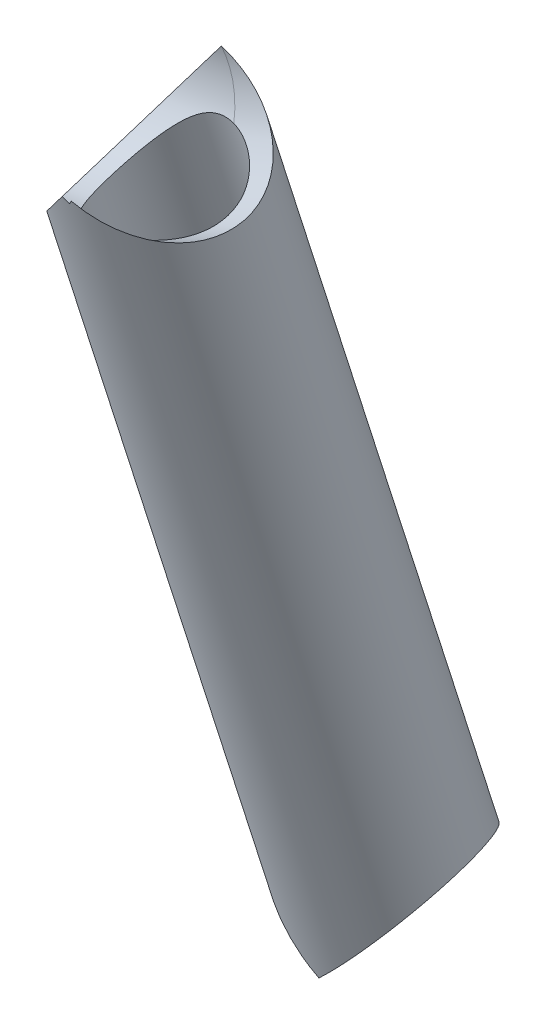
ISO-10303-21;
HEADER;
FILE_DESCRIPTION(('STEP AP214'),'2;1');
FILE_NAME('part.step','',(''),(''),'','','');
FILE_SCHEMA(('AUTOMOTIVE_DESIGN { 1 0 10303 214 1 1 1 1 }'));
ENDSEC;
DATA;
#1=APPLICATION_CONTEXT('core data for automotive mechanical design processes');
#2=APPLICATION_PROTOCOL_DEFINITION('international standard','automotive_design',2000,#1);
#3=PRODUCT_CONTEXT('',#1,'mechanical');
#4=PRODUCT('Part','Part','',(#3));
#5=PRODUCT_RELATED_PRODUCT_CATEGORY('part','',(#4));
#6=PRODUCT_DEFINITION_FORMATION('','',#4);
#7=PRODUCT_DEFINITION_CONTEXT('part definition',#1,'design');
#8=PRODUCT_DEFINITION('design','',#6,#7);
#9=PRODUCT_DEFINITION_SHAPE('','',#8);
#10=(LENGTH_UNIT() NAMED_UNIT(*) SI_UNIT(.MILLI.,.METRE.));
#11=(NAMED_UNIT(*) PLANE_ANGLE_UNIT() SI_UNIT($,.RADIAN.));
#12=(NAMED_UNIT(*) SI_UNIT($,.STERADIAN.) SOLID_ANGLE_UNIT());
#13=UNCERTAINTY_MEASURE_WITH_UNIT(LENGTH_MEASURE(1.E-05),#10,'distance_accuracy_value','');
#14=(GEOMETRIC_REPRESENTATION_CONTEXT(3) GLOBAL_UNCERTAINTY_ASSIGNED_CONTEXT((#13)) GLOBAL_UNIT_ASSIGNED_CONTEXT((#10,
#11,#12)) REPRESENTATION_CONTEXT('',''));
#15=CARTESIAN_POINT('',(0.,0.,0.));
#16=DIRECTION('',(0.,0.,1.));
#17=DIRECTION('',(1.,0.,0.));
#18=AXIS2_PLACEMENT_3D('',#15,#16,#17);
#19=CARTESIAN_POINT('',(549.76326332179,1.17961196366423E-13,200.));
#20=DIRECTION('',(0.,0.95272535252887,0.303832853142546));
#21=DIRECTION('',(0.,-0.303832853142546,0.952725352528871));
#22=AXIS2_PLACEMENT_3D('',#19,#20,#21);
#23=CYLINDRICAL_SURFACE('',#22,9.65000000000003);
#24=CARTESIAN_POINT('',(550.698039428662,109.484435551692,244.996794368476));
#25=CARTESIAN_POINT('',(550.881581643102,109.566394338462,245.004213785763));
#26=CARTESIAN_POINT('',(551.067205147599,109.644542456331,245.004567755101));
#27=CARTESIAN_POINT('',(551.441272790003,109.792442626243,244.990319027908));
#28=CARTESIAN_POINT('',(551.629717996396,109.862191402456,244.97571051683));
#29=CARTESIAN_POINT('',(552.006309312038,109.991890817097,244.930898310792));
#30=CARTESIAN_POINT('',(552.194443954556,110.051920856962,244.900830360672));
#31=CARTESIAN_POINT('',(552.570217718864,110.162658830874,244.824920725487));
#32=CARTESIAN_POINT('',(552.757856955263,110.213369149442,244.77908308386));
#33=CARTESIAN_POINT('',(553.131337378484,110.305875102178,244.671707070123));
#34=CARTESIAN_POINT('',(553.317173070384,110.347648714515,244.610130715032));
#35=CARTESIAN_POINT('',(553.684904472099,110.422906426049,244.471971576444));
#36=CARTESIAN_POINT('',(553.866799660256,110.456389433752,244.395386819401));
#37=CARTESIAN_POINT('',(554.225484036437,110.516245356894,244.228022283843));
#38=CARTESIAN_POINT('',(554.402264543243,110.54260675216,244.137219876654));
#39=CARTESIAN_POINT('',(554.749321723969,110.589495836218,243.942584303863));
#40=CARTESIAN_POINT('',(554.919596748016,110.610022053525,243.838747860903));
#41=CARTESIAN_POINT('',(555.299177028189,110.651736875844,243.588575847054));
#42=CARTESIAN_POINT('',(555.506148369993,110.671518490651,243.438457210947));
#43=CARTESIAN_POINT('',(555.906788012326,110.706638809108,243.120934223244));
#44=CARTESIAN_POINT('',(556.100452562977,110.721976264272,242.953525032138));
#45=CARTESIAN_POINT('',(556.473769897959,110.750737217947,242.603205122193));
#46=CARTESIAN_POINT('',(556.653405791074,110.764158424818,242.420276253129));
#47=CARTESIAN_POINT('',(556.997666401102,110.791242420639,242.040864301523));
#48=CARTESIAN_POINT('',(557.162292190321,110.804905192248,241.844382188974));
#49=CARTESIAN_POINT('',(557.478348379293,110.834550919873,241.436261312558));
#50=CARTESIAN_POINT('',(557.629530642542,110.850566975223,241.224432829273));
#51=CARTESIAN_POINT('',(557.915033371628,110.886373108481,240.790003674337));
#52=CARTESIAN_POINT('',(558.049353720248,110.906163212622,240.567402927815));
#53=CARTESIAN_POINT('',(558.300343888742,110.950843614606,240.1130933081));
#54=CARTESIAN_POINT('',(558.417022553328,110.975731341903,239.881389072871));
#55=CARTESIAN_POINT('',(558.632072138232,111.031693868641,239.41034225666));
#56=CARTESIAN_POINT('',(558.73044238973,111.062768894023,239.170999397007));
#57=CARTESIAN_POINT('',(558.914537580053,111.134441459816,238.66887530459));
#58=CARTESIAN_POINT('',(558.998844049748,111.175563161971,238.405646463527));
#59=CARTESIAN_POINT('',(559.14474216268,111.26663147728,237.874436356593));
#60=CARTESIAN_POINT('',(559.206332567954,111.316578571175,237.606454832547));
#61=CARTESIAN_POINT('',(559.306082308514,111.42572068666,237.068043330455));
#62=CARTESIAN_POINT('',(559.34424420614,111.484914696041,236.797613623447));
#63=CARTESIAN_POINT('',(559.396629612229,111.612668506386,236.2566534733));
#64=CARTESIAN_POINT('',(559.410854975487,111.681227581225,235.986123039592));
#65=CARTESIAN_POINT('',(559.41497267861,111.822775813274,235.464792583113));
#66=CARTESIAN_POINT('',(559.406378912521,111.895191884138,235.213847854031));
#67=CARTESIAN_POINT('',(559.368035815093,112.047628921864,234.715920544952));
#68=CARTESIAN_POINT('',(559.338287390049,112.127649562809,234.468937795682));
#69=CARTESIAN_POINT('',(559.257879022078,112.294648434509,233.980850403866));
#70=CARTESIAN_POINT('',(559.207222671558,112.381625467945,233.739744759047));
#71=CARTESIAN_POINT('',(559.08545419463,112.561710102316,233.265112507336));
#72=CARTESIAN_POINT('',(559.014342171348,112.654817672343,233.031585862242));
#73=CARTESIAN_POINT('',(558.854852446097,112.843140803751,232.58085840355));
#74=CARTESIAN_POINT('',(558.767084963752,112.938199118691,232.363375364454));
#75=CARTESIAN_POINT('',(558.573698403751,113.132029938323,231.938240267824));
#76=CARTESIAN_POINT('',(558.468079840252,113.230802335974,231.730587927359));
#77=CARTESIAN_POINT('',(558.239827336573,113.43085231516,231.326173037617));
#78=CARTESIAN_POINT('',(558.117195261543,113.532129621088,231.12940929795));
#79=CARTESIAN_POINT('',(557.855783983508,113.73588508475,230.747580192732));
#80=CARTESIAN_POINT('',(557.717004132927,113.838363290496,230.562515296802));
#81=CARTESIAN_POINT('',(557.417454025893,114.04779533895,230.196500000782));
#82=CARTESIAN_POINT('',(557.255965694797,114.154738123503,230.016130864163));
#83=CARTESIAN_POINT('',(556.917315168159,114.36656108676,229.669445096046));
#84=CARTESIAN_POINT('',(556.740152440746,114.471441195325,229.503128941775));
#85=CARTESIAN_POINT('',(556.370804864086,114.67731490012,229.184630482026));
#86=CARTESIAN_POINT('',(556.17859413249,114.778301333519,229.032473559324));
#87=CARTESIAN_POINT('',(555.780365612246,114.973919860812,228.742837046828));
#88=CARTESIAN_POINT('',(555.574347472067,115.068551792801,228.605357830953));
#89=CARTESIAN_POINT('',(555.136205118418,115.254475255379,228.337075078194));
#90=CARTESIAN_POINT('',(554.903254144052,115.345192436493,228.20721937849));
#91=CARTESIAN_POINT('',(554.423984993501,115.512913232271,227.964174746746));
#92=CARTESIAN_POINT('',(554.177664101202,115.589914046731,227.850989218744));
#93=CARTESIAN_POINT('',(553.674012405421,115.725757345622,227.641584260961));
#94=CARTESIAN_POINT('',(553.416719274576,115.78465703395,227.545311803749));
#95=CARTESIAN_POINT('',(552.892562630669,115.879942104992,227.369193553604));
#96=CARTESIAN_POINT('',(552.625705560243,115.916342353425,227.28933693781));
#97=CARTESIAN_POINT('',(552.172695592737,115.954626211558,227.168930621738));
#98=CARTESIAN_POINT('',(551.98830034342,115.963859191771,227.124014028903));
#99=CARTESIAN_POINT('',(551.617736437598,115.968626230974,227.041423558787));
#100=CARTESIAN_POINT('',(551.431568284748,115.96416407124,227.00374768537));
#101=CARTESIAN_POINT('',(551.058960029859,115.940610303518,226.935455022241));
#102=CARTESIAN_POINT('',(550.872520152049,115.921527297861,226.90483409545));
#103=CARTESIAN_POINT('',(550.500862439488,115.868320136744,226.850362452704));
#104=CARTESIAN_POINT('',(550.315644350711,115.834199214752,226.826510283135));
#105=CARTESIAN_POINT('',(549.890174376933,115.737950368295,226.778759760704));
#106=CARTESIAN_POINT('',(549.650857480254,115.670397418027,226.757187374206));
#107=CARTESIAN_POINT('',(549.297590076094,115.551063811716,226.732497674503));
#108=CARTESIAN_POINT('',(549.180755973486,115.508271781476,226.725545111857));
#109=CARTESIAN_POINT('',(548.94919801947,115.417028447761,226.71408248341));
#110=CARTESIAN_POINT('',(548.834474108189,115.368577305141,226.709572348204));
#111=CARTESIAN_POINT('',(548.720894557649,115.317466106978,226.706224291481));
#112=B_SPLINE_CURVE_WITH_KNOTS('',3,(#24,#25,#26,#27,#28,#29,#30,#31,#32,#33,#34,#35,#36,#37,
#38,#39,#40,#41,#42,#43,#44,#45,#46,#47,#48,#49,#50,#51,#52,#53,#54,#55,#56,#57,#58,#59,#60,#61,
#62,#63,#64,#65,#66,#67,#68,#69,#70,#71,#72,#73,#74,#75,#76,#77,#78,#79,#80,#81,#82,#83,#84,#85,
#86,#87,#88,#89,#90,#91,#92,#93,#94,#95,#96,#97,#98,#99,#100,#101,#102,#103,#104,#105,#106,#107,
#108,#109,#110,#111),.UNSPECIFIED.,.F.,.F.,(4,2,2,2,2,2,2,2,2,2,2,2,2,2,2,2,2,2,2,2,2,2,2,2,2,2,
2,2,2,2,2,2,2,2,2,2,2,2,2,2,2,2,2,4),(0.,0.603401911009914,1.20703839807765,1.80546282042542,
2.40373391754958,3.0034627125777,3.6032704225785,4.20404267070255,4.80496628437935,
5.57321395701299,6.34167724277525,7.11105197133311,7.88037169345746,8.66178608143956,
9.44320590124379,10.2242326454021,11.0052879154709,11.8425224944068,12.6798026935898,
13.5169913043671,14.3541150400877,15.1371105115038,15.9200724402833,16.7028998962525,
17.4857234057292,18.2440396320003,19.0023340204592,19.7605453445096,20.518787085754,
21.3119222678827,22.1050843734451,22.8996420142938,23.6942198918678,24.538244731251,
25.3824416816996,26.2239426625353,27.064887055007,27.6343517263137,28.2036591805505,
28.7726319335976,29.3414824051636,30.0885224507664,30.462236794177,30.8359405176508),.UNSPECIFIED.);
#113=CARTESIAN_POINT('',(552.9506630298,110.261122917512,244.723648048167));
#114=VERTEX_POINT('',#113);
#115=CARTESIAN_POINT('',(552.000788998511,115.961111324283,227.128263209496));
#116=VERTEX_POINT('',#115);
#117=EDGE_CURVE('E116',#114,#116,#112,.T.);
#118=ORIENTED_EDGE('',*,*,#117,.T.);
#119=CARTESIAN_POINT('',(549.76326332179,109.975863240767,245.201148674115));
#120=CARTESIAN_POINT('',(549.9634546001,110.019916320632,245.215196869599));
#121=CARTESIAN_POINT('',(550.165307901028,110.059083582522,245.221137583805));
#122=CARTESIAN_POINT('',(550.570552825056,110.127049074594,245.216106583122));
#123=CARTESIAN_POINT('',(550.773944438698,110.155847368475,245.205134972132));
#124=CARTESIAN_POINT('',(551.180423033904,110.203144725606,245.16612172139));
#125=CARTESIAN_POINT('',(551.383509708,110.221636660967,245.138068295826));
#126=CARTESIAN_POINT('',(551.787316770269,110.248998695428,245.065298121469));
#127=CARTESIAN_POINT('',(551.98803699928,110.257868150948,245.020580258379));
#128=CARTESIAN_POINT('',(552.383703703847,110.267166591259,244.915794468131));
#129=CARTESIAN_POINT('',(552.578685512266,110.267669415926,244.855865572658));
#130=CARTESIAN_POINT('',(552.963528778638,110.261908055358,244.721530033714));
#131=CARTESIAN_POINT('',(553.15338755417,110.255640392959,244.647115967093));
#132=CARTESIAN_POINT('',(553.714229729974,110.229072097724,244.403684156985));
#133=CARTESIAN_POINT('',(554.07628523899,110.201004703115,244.214529724227));
#134=CARTESIAN_POINT('',(554.666278688278,110.146113621938,243.855499316274));
#135=CARTESIAN_POINT('',(554.90165491087,110.12148241524,243.697102594484));
#136=CARTESIAN_POINT('',(555.358004067127,110.071501830009,243.360642036257));
#137=CARTESIAN_POINT('',(555.578972330568,110.046152222395,243.182571872731));
#138=CARTESIAN_POINT('',(556.005820845144,109.997716098286,242.808634613583));
#139=CARTESIAN_POINT('',(556.211689075402,109.97463138,242.612753611002));
#140=CARTESIAN_POINT('',(556.607410978175,109.933294290981,242.204993684445));
#141=CARTESIAN_POINT('',(556.797266232797,109.91504144247,241.993116344861));
#142=CARTESIAN_POINT('',(557.16199318824,109.885404324874,241.552591687812));
#143=CARTESIAN_POINT('',(557.336686679089,109.874094169562,241.323791676807));
#144=CARTESIAN_POINT('',(557.667738161875,109.860603739476,240.853003599556));
#145=CARTESIAN_POINT('',(557.82409565684,109.858423712105,240.611015176116));
#146=CARTESIAN_POINT('',(558.117116334747,109.864874764263,240.115731230429));
#147=CARTESIAN_POINT('',(558.253793105132,109.873498344766,239.862443668809));
#148=CARTESIAN_POINT('',(558.506224741361,109.902947677151,239.34631550793));
#149=CARTESIAN_POINT('',(558.621980840241,109.923772709591,239.083475472778));
#150=CARTESIAN_POINT('',(558.828082916247,109.977900091243,238.558362449391));
#151=CARTESIAN_POINT('',(558.919084636021,110.01081114634,238.296307051674));
#152=CARTESIAN_POINT('',(559.078946387722,110.089836451659,237.76744963628));
#153=CARTESIAN_POINT('',(559.147806588626,110.135950601113,237.500647654845));
#154=CARTESIAN_POINT('',(559.262355117916,110.241678135343,236.964920118654));
#155=CARTESIAN_POINT('',(559.308057990581,110.301283012962,236.695996004802));
#156=CARTESIAN_POINT('',(559.375637075682,110.433943460572,236.158480587196));
#157=CARTESIAN_POINT('',(559.397516112611,110.506997434873,235.889889247762));
#158=CARTESIAN_POINT('',(559.415953366756,110.656731163836,235.387073849114));
#159=CARTESIAN_POINT('',(559.415182232547,110.731978842211,235.152516344233));
#160=CARTESIAN_POINT('',(559.394828533204,110.891991545254,234.687516635222));
#161=CARTESIAN_POINT('',(559.375247702842,110.976755691605,234.457074053578));
#162=CARTESIAN_POINT('',(559.317527538014,111.155000094427,234.001988694555));
#163=CARTESIAN_POINT('',(559.279389686438,111.248479653968,233.777345455261));
#164=CARTESIAN_POINT('',(559.185022271188,111.44318287009,233.335337647127));
#165=CARTESIAN_POINT('',(559.12879236789,111.544406672018,233.117973215008));
#166=CARTESIAN_POINT('',(559.000371600791,111.751078284084,232.696698650233));
#167=CARTESIAN_POINT('',(558.928574897405,111.85637667972,232.492594559923));
#168=CARTESIAN_POINT('',(558.769042116872,112.072137351278,232.09357475383));
#169=CARTESIAN_POINT('',(558.681306482387,112.182599483728,231.89865878306));
#170=CARTESIAN_POINT('',(558.490685437882,112.407459048784,231.518806508098));
#171=CARTESIAN_POINT('',(558.387801531828,112.521856089858,231.33386921568));
#172=CARTESIAN_POINT('',(558.16766851358,112.753333443992,230.974509955233));
#173=CARTESIAN_POINT('',(558.050417781106,112.87041405849,230.800089176564));
#174=CARTESIAN_POINT('',(557.79135055153,113.11635895838,230.447211623137));
#175=CARTESIAN_POINT('',(557.648278285843,113.245349010812,230.269764019591));
#176=CARTESIAN_POINT('',(557.346974508563,113.503158797502,229.928116467741));
#177=CARTESIAN_POINT('',(557.188742149096,113.631978521825,229.763917261338));
#178=CARTESIAN_POINT('',(556.857648324522,113.887788248378,229.448615885941));
#179=CARTESIAN_POINT('',(556.684760892019,114.014774515625,229.297537967432));
#180=CARTESIAN_POINT('',(556.325318993714,114.264610029118,229.008821105734));
#181=CARTESIAN_POINT('',(556.138764223729,114.387459183199,228.871182461812));
#182=CARTESIAN_POINT('',(555.730287647052,114.640530891462,228.594147632414));
#183=CARTESIAN_POINT('',(555.506768715832,114.769968738686,228.456381003873));
#184=CARTESIAN_POINT('',(555.044138173575,115.017160632341,228.197282697493));
#185=CARTESIAN_POINT('',(554.805022261513,115.134911433186,228.07595558164));
#186=CARTESIAN_POINT('',(554.312644914728,115.354025867711,227.84989583402));
#187=CARTESIAN_POINT('',(554.059418715352,115.455428057967,227.745124169849));
#188=CARTESIAN_POINT('',(553.539565934702,115.636988281309,227.55178657457));
#189=CARTESIAN_POINT('',(553.272949122394,115.717161541404,227.463209041988));
#190=CARTESIAN_POINT('',(552.824755455249,115.827013239295,227.330704057435));
#191=CARTESIAN_POINT('',(552.646463192946,115.864521215445,227.282066722795));
#192=CARTESIAN_POINT('',(552.286004325275,115.92681066068,227.191541813069));
#193=CARTESIAN_POINT('',(552.103838996273,115.951596256737,227.149652052189));
#194=CARTESIAN_POINT('',(551.737025438186,115.98709452443,227.072678501808));
#195=CARTESIAN_POINT('',(551.552381914302,115.997830858015,227.037583353916));
#196=CARTESIAN_POINT('',(551.181667380839,116.004352674121,226.974084567425));
#197=CARTESIAN_POINT('',(550.99559635377,116.000137973163,226.945681010948));
#198=CARTESIAN_POINT('',(550.623061856763,115.97629910435,226.895430534109));
#199=CARTESIAN_POINT('',(550.436598614483,115.956635164842,226.873600737788));
#200=CARTESIAN_POINT('',(550.065278379949,115.90204078665,226.836467912011));
#201=CARTESIAN_POINT('',(549.880421369628,115.867110519894,226.821164809057));
#202=CARTESIAN_POINT('',(549.513439215618,115.782709943031,226.79689176459));
#203=CARTESIAN_POINT('',(549.331317298806,115.73322368968,226.787928804314));
#204=CARTESIAN_POINT('',(548.971006729789,115.620932728738,226.776152520109));
#205=CARTESIAN_POINT('',(548.792819228331,115.558124180121,226.773340972379));
#206=CARTESIAN_POINT('',(548.379848438894,115.396700469569,226.773719529044));
#207=CARTESIAN_POINT('',(548.146960302229,115.293232295231,226.779340027354));
#208=CARTESIAN_POINT('',(547.690474654813,115.068461753578,226.800956057156));
#209=CARTESIAN_POINT('',(547.466880860139,114.947152339269,226.816955696793));
#210=CARTESIAN_POINT('',(547.028522828361,114.68981885095,226.859109652717));
#211=CARTESIAN_POINT('',(546.813785620311,114.553753757949,226.885292828348));
#212=CARTESIAN_POINT('',(546.393587795436,114.270194573631,226.947694627227));
#213=CARTESIAN_POINT('',(546.188127232081,114.12270041645,226.983913308309));
#214=CARTESIAN_POINT('',(545.690426062326,113.74647561094,227.086058375244));
#215=CARTESIAN_POINT('',(545.403376366959,113.512465551212,227.157921715903));
#216=CARTESIAN_POINT('',(544.847363307928,113.031251542761,227.324302964778));
#217=CARTESIAN_POINT('',(544.578409130546,112.784041005272,227.418832270005));
#218=CARTESIAN_POINT('',(544.058219571466,112.281513503806,227.631729483467));
#219=CARTESIAN_POINT('',(543.806979909307,112.026198519926,227.750091606003));
#220=CARTESIAN_POINT('',(543.322465974213,111.511750381845,228.012256113292));
#221=CARTESIAN_POINT('',(543.089184234729,111.252618868457,228.15604784202));
#222=CARTESIAN_POINT('',(542.693159774841,110.794199446877,228.434734406057));
#223=CARTESIAN_POINT('',(542.526539305416,110.594864638065,228.564060197769));
#224=CARTESIAN_POINT('',(542.205438016533,110.198230879066,228.839884202087));
#225=CARTESIAN_POINT('',(542.050957207784,110.000931930674,228.986382429841));
#226=CARTESIAN_POINT('',(541.755654889493,109.610880123103,229.297169381766));
#227=CARTESIAN_POINT('',(541.614809450212,109.418119766042,229.461425827097));
#228=CARTESIAN_POINT('',(541.348105636225,109.039249332012,229.808672344227));
#229=CARTESIAN_POINT('',(541.222241438681,108.853136691055,229.99165508581));
#230=CARTESIAN_POINT('',(541.015760298076,108.534094796603,230.330324404103));
#231=CARTESIAN_POINT('',(540.931552718786,108.399166555664,230.481947201521));
#232=CARTESIAN_POINT('',(540.773866289386,108.136128246428,230.796163573139));
#233=CARTESIAN_POINT('',(540.700381304537,108.008014306327,230.958750795761));
#234=CARTESIAN_POINT('',(540.565117055794,107.760008762316,231.29468557097));
#235=CARTESIAN_POINT('',(540.503335380576,107.640115467897,231.468030897188));
#236=CARTESIAN_POINT('',(540.392467147528,107.410029486356,231.824958004935));
#237=CARTESIAN_POINT('',(540.343380721977,107.299836900319,232.008539893101));
#238=CARTESIAN_POINT('',(540.258482834333,107.089786862604,232.386566584015));
#239=CARTESIAN_POINT('',(540.222783944748,106.990021928253,232.581088351116));
#240=CARTESIAN_POINT('',(540.166002506339,106.803283109686,232.978257787773));
#241=CARTESIAN_POINT('',(540.144919905149,106.716309179643,233.180905428213));
#242=CARTESIAN_POINT('',(540.117866654351,106.556355398659,233.5925220117));
#243=CARTESIAN_POINT('',(540.111888466098,106.483368583534,233.801487748648));
#244=CARTESIAN_POINT('',(540.115168413285,106.352146640046,234.223871262179));
#245=CARTESIAN_POINT('',(540.124425184088,106.293910190991,234.437288638327));
#246=CARTESIAN_POINT('',(540.155876129218,106.198811947143,234.840021792754));
#247=CARTESIAN_POINT('',(540.176334833758,106.160200223417,235.029065564939));
#248=CARTESIAN_POINT('',(540.2284303565,106.094558262766,235.407690100039));
#249=CARTESIAN_POINT('',(540.260071275486,106.067532282667,235.59727103461));
#250=CARTESIAN_POINT('',(540.334012807019,106.024828407898,235.97562156837));
#251=CARTESIAN_POINT('',(540.376313758545,106.009150874159,236.164391141565));
#252=CARTESIAN_POINT('',(540.470948023295,105.988686022466,236.540007276758));
#253=CARTESIAN_POINT('',(540.523283436459,105.98390098672,236.726853427595));
#254=CARTESIAN_POINT('',(540.654223571681,105.984744663654,237.152665718845));
#255=CARTESIAN_POINT('',(540.73601583267,105.993882791806,237.390654605637));
#256=CARTESIAN_POINT('',(540.913767351944,106.027938353897,237.860057627066));
#257=CARTESIAN_POINT('',(541.009730174823,106.052859763312,238.091470089891));
#258=CARTESIAN_POINT('',(541.316961370928,106.148927047828,238.774590645774));
#259=CARTESIAN_POINT('',(541.547484400736,106.241371793227,239.214903226503));
#260=CARTESIAN_POINT('',(541.970244419686,106.43361206851,239.924955111587));
#261=CARTESIAN_POINT('',(542.151611865375,106.521884939514,240.204678988825));
#262=CARTESIAN_POINT('',(542.531680084085,106.715018727272,240.746280918159));
#263=CARTESIAN_POINT('',(542.730387632222,106.819886140971,241.008151922963));
#264=CARTESIAN_POINT('',(543.144092194265,107.042893165864,241.513858674705));
#265=CARTESIAN_POINT('',(543.359131232113,107.161067422523,241.757644467474));
#266=CARTESIAN_POINT('',(543.804211273161,107.40703834607,242.225795854723));
#267=CARTESIAN_POINT('',(544.034250127505,107.534833635063,242.450164220251));
#268=CARTESIAN_POINT('',(544.516198841488,107.800541725061,242.88499198106));
#269=CARTESIAN_POINT('',(544.768554530637,107.938642034866,243.09484309286));
#270=CARTESIAN_POINT('',(545.28948826406,108.217551653759,243.491637990458));
#271=CARTESIAN_POINT('',(545.558072199016,108.358361933745,243.678573382606));
#272=CARTESIAN_POINT('',(546.111342556936,108.637620124482,244.026424740333));
#273=CARTESIAN_POINT('',(546.395969488808,108.776074566508,244.187429267102));
#274=CARTESIAN_POINT('',(546.982858672242,109.045532171543,244.480362911299));
#275=CARTESIAN_POINT('',(547.285103277819,109.176542539353,244.612320510282));
#276=CARTESIAN_POINT('',(547.937928888575,109.436475440679,244.853052236188));
#277=CARTESIAN_POINT('',(548.290374491198,109.564018441295,244.958435126517));
#278=CARTESIAN_POINT('',(548.833304491107,109.735185653313,245.079064636691));
#279=CARTESIAN_POINT('',(549.016574484542,109.788864352978,245.11302696243));
#280=CARTESIAN_POINT('',(549.387159273421,109.888429217533,245.167441886946));
#281=CARTESIAN_POINT('',(549.574472237791,109.934318829984,245.187900474314));
#282=CARTESIAN_POINT('',(549.76326332179,109.975863240767,245.201148674115));
#283=B_SPLINE_CURVE_WITH_KNOTS('',3,(#119,#120,#121,#122,#123,#124,#125,#126,#127,#128,#129,
#130,#131,#132,#133,#134,#135,#136,#137,#138,#139,#140,#141,#142,#143,#144,#145,#146,#147,#148,
#149,#150,#151,#152,#153,#154,#155,#156,#157,#158,#159,#160,#161,#162,#163,#164,#165,#166,#167,
#168,#169,#170,#171,#172,#173,#174,#175,#176,#177,#178,#179,#180,#181,#182,#183,#184,#185,#186,
#187,#188,#189,#190,#191,#192,#193,#194,#195,#196,#197,#198,#199,#200,#201,#202,#203,#204,#205,
#206,#207,#208,#209,#210,#211,#212,#213,#214,#215,#216,#217,#218,#219,#220,#221,#222,#223,#224,
#225,#226,#227,#228,#229,#230,#231,#232,#233,#234,#235,#236,#237,#238,#239,#240,#241,#242,#243,
#244,#245,#246,#247,#248,#249,#250,#251,#252,#253,#254,#255,#256,#257,#258,#259,#260,#261,#262,
#263,#264,#265,#266,#267,#268,#269,#270,#271,#272,#273,#274,#275,#276,#277,#278,#279,#280,#281,
#282),.UNSPECIFIED.,.T.,.F.,(4,2,2,2,2,2,2,2,2,2,2,2,2,2,2,2,2,2,2,2,2,2,2,2,2,2,2,2,2,2,2,2,2,
2,2,2,2,2,2,2,2,2,2,2,2,2,2,2,2,2,2,2,2,2,2,2,2,2,2,2,2,2,2,2,2,2,2,2,2,2,2,2,2,2,2,2,2,2,2,2,2,
4),(0.,0.616169531446662,1.23233527751867,1.84892663732323,2.46555923395674,3.0767468112761,
3.68824842967294,4.91184767117764,5.76528018930683,6.61898797946948,7.47336817689521,
8.32766386111556,9.19092744856187,10.054214428202,10.9169025128609,11.7795397352608,
12.6164089643081,13.4532718065052,14.289608391957,15.125845812681,15.8639281070358,
16.6019423363992,17.339897600816,18.0778667189189,18.7989695164123,19.5200522902497,
20.2410635210506,20.9621561419184,21.7470721693637,22.5320321211617,23.3184132468746,
24.1048118797398,24.9819457509242,25.8593225316241,26.7345988414684,27.609245625165,
28.1744582525344,28.7394874163607,29.3035637207212,29.867646947465,30.4331870956101,
30.9987208748308,31.5648764073111,32.1311953936488,32.8946879732715,33.6584829336766,
34.4244583888087,35.1904382584323,36.3206425205577,37.4514162736856,38.5819158483369,
39.7119428159567,40.5818909940019,41.451839939445,42.320233364585,43.1882881568142,
43.846937574009,44.5052086666952,45.1633439827495,45.8214861560418,46.4850445960519,
47.1486006586479,47.8118254734791,48.4749908847163,49.0564072482483,49.638037052712,
50.2196853548282,50.8014555132847,51.5557677532985,52.3102700642073,53.8201407029631,
54.8536123698262,55.8874896578559,56.9241238432006,57.9606098463812,59.0277756588978,
60.0953311960612,61.1591596562796,62.2219403014201,63.3856386186772,63.9669774304113,
64.548058258465),.UNSPECIFIED.);
#284=EDGE_CURVE('E101',#116,#114,#283,.T.);
#285=ORIENTED_EDGE('',*,*,#284,.T.);
#286=EDGE_LOOP('',(#118,#285));
#287=FACE_BOUND('',#286,.T.);
#288=CARTESIAN_POINT('',(549.76326332179,4.93405758676842,211.702353427001));
#289=CARTESIAN_POINT('',(549.539382373849,4.93406342137036,211.702352633379));
#290=CARTESIAN_POINT('',(549.315467333172,4.94515863877274,211.69769189549));
#291=CARTESIAN_POINT('',(548.870141430401,4.9889123854776,211.679096439812));
#292=CARTESIAN_POINT('',(548.648731172296,5.02157600747869,211.665159531742));
#293=CARTESIAN_POINT('',(548.209954175847,5.10683350079741,211.628086715795));
#294=CARTESIAN_POINT('',(547.992600772254,5.15948395384225,211.604924682805));
#295=CARTESIAN_POINT('',(547.564056959244,5.28228048027909,211.549546927131));
#296=CARTESIAN_POINT('',(547.352869013883,5.35243344454773,211.517327637901));
#297=CARTESIAN_POINT('',(546.894798854644,5.52357016230345,211.436383431863));
#298=CARTESIAN_POINT('',(546.64954129666,5.62792862982246,211.385624628943));
#299=CARTESIAN_POINT('',(546.170197428191,5.85374599420569,211.271187764417));
#300=CARTESIAN_POINT('',(545.936114353462,5.97520980446699,211.207505988446));
#301=CARTESIAN_POINT('',(545.479183708733,6.23143778474619,211.067092877763));
#302=CARTESIAN_POINT('',(545.25634644083,6.36621382730404,210.990349849436));
#303=CARTESIAN_POINT('',(544.822200053088,6.64568072831884,210.823650244243));
#304=CARTESIAN_POINT('',(544.610889940415,6.79037073045706,210.733694807834));
#305=CARTESIAN_POINT('',(544.194956599262,7.09045100515503,210.537948424183));
#306=CARTESIAN_POINT('',(543.990611148519,7.24601374274605,210.431832281636));
#307=CARTESIAN_POINT('',(543.594262008462,7.56214160906966,210.204992451836));
#308=CARTESIAN_POINT('',(543.402258713888,7.72270689755554,210.084268297729));
#309=CARTESIAN_POINT('',(543.031188721571,8.04646301319454,209.827870724339));
#310=CARTESIAN_POINT('',(542.852111874307,8.20965165469263,209.692209249572));
#311=CARTESIAN_POINT('',(542.507419928198,8.53668655044997,209.405438687285));
#312=CARTESIAN_POINT('',(542.341804195637,8.70053277337035,209.254330327724));
#313=CARTESIAN_POINT('',(542.031624071376,9.01999803058381,208.943001327277));
#314=CARTESIAN_POINT('',(541.886467779545,9.1756736673092,208.783429621454));
#315=CARTESIAN_POINT('',(541.610421834209,9.48393590934119,208.449648178238));
#316=CARTESIAN_POINT('',(541.479530072152,9.63652296847231,208.275440611047));
#317=CARTESIAN_POINT('',(541.233196878122,9.93677164681734,207.912398587017));
#318=CARTESIAN_POINT('',(541.117756291123,10.0844329963294,207.72356333113));
#319=CARTESIAN_POINT('',(540.903679522184,10.372882503838,207.331609950067));
#320=CARTESIAN_POINT('',(540.805043207599,10.5136707160816,207.128491937652));
#321=CARTESIAN_POINT('',(540.62513881932,10.78765939194,206.706729085931));
#322=CARTESIAN_POINT('',(540.544041143911,10.920776930604,206.487957205291));
#323=CARTESIAN_POINT('',(540.401776604969,11.1759534437133,206.037796535081));
#324=CARTESIAN_POINT('',(540.340610036993,11.2980122541509,205.806407558474));
#325=CARTESIAN_POINT('',(540.23945886749,11.5290245895431,205.332999473607));
#326=CARTESIAN_POINT('',(540.199452060887,11.6379917596709,205.090991798697));
#327=CARTESIAN_POINT('',(540.14139179329,11.8412850236347,204.59836121107));
#328=CARTESIAN_POINT('',(540.12333433724,11.9356137791184,204.347739874689));
#329=CARTESIAN_POINT('',(540.110619452725,12.0950920883933,203.879461933705));
#330=CARTESIAN_POINT('',(540.112795475943,12.1624980533817,203.662650736906));
#331=CARTESIAN_POINT('',(540.133110055637,12.285414423542,203.226440315285));
#332=CARTESIAN_POINT('',(540.151246665382,12.3409262784256,203.007041409308));
#333=CARTESIAN_POINT('',(540.203188628909,12.4398284841818,202.567381736479));
#334=CARTESIAN_POINT('',(540.236994006433,12.4832188166868,202.347120968321));
#335=CARTESIAN_POINT('',(540.319754189131,12.5579272912323,201.907406220708));
#336=CARTESIAN_POINT('',(540.368709401112,12.5892451090487,201.687952263079));
#337=CARTESIAN_POINT('',(540.479291544733,12.6392997087684,201.258329127057));
#338=CARTESIAN_POINT('',(540.540468143555,12.658403465506,201.048085985577));
#339=CARTESIAN_POINT('',(540.675661666445,12.6860372814786,200.630998059639));
#340=CARTESIAN_POINT('',(540.749683005687,12.6945636966824,200.424154470574));
#341=CARTESIAN_POINT('',(540.909745174142,12.7016381457526,200.01508576223));
#342=CARTESIAN_POINT('',(540.99578244791,12.7001891251902,199.812859297291));
#343=CARTESIAN_POINT('',(541.179138877267,12.6880356550713,199.413808615137));
#344=CARTESIAN_POINT('',(541.276462073463,12.6773278817655,199.216986364133));
#345=CARTESIAN_POINT('',(541.495117119762,12.6454781114544,198.80408762712));
#346=CARTESIAN_POINT('',(541.617923149336,12.6231490725311,198.58888314835));
#347=CARTESIAN_POINT('',(541.876052067137,12.5688649180614,198.167287152885));
#348=CARTESIAN_POINT('',(542.011380274374,12.5369056988033,197.960899436173));
#349=CARTESIAN_POINT('',(542.293800682272,12.464613101556,197.557576524867));
#350=CARTESIAN_POINT('',(542.440904355347,12.4242714943326,197.360650855126));
#351=CARTESIAN_POINT('',(542.746012680416,12.336583045285,196.977186795768));
#352=CARTESIAN_POINT('',(542.904014510528,12.2892380132646,196.790645739681));
#353=CARTESIAN_POINT('',(543.263803932326,12.1786586729623,196.391473441971));
#354=CARTESIAN_POINT('',(543.467939883751,12.1141546808253,196.181303497993));
#355=CARTESIAN_POINT('',(543.890709042671,11.979546029248,195.777951131971));
#356=CARTESIAN_POINT('',(544.109345734109,11.9094400230345,195.584772818453));
#357=CARTESIAN_POINT('',(544.560790617383,11.7664762461639,195.216804011491));
#358=CARTESIAN_POINT('',(544.793598481995,11.6936185390604,195.042013093721));
#359=CARTESIAN_POINT('',(545.273099502032,11.5484564816201,194.71269780691));
#360=CARTESIAN_POINT('',(545.519787597184,11.4761519403986,194.558166119568));
#361=CARTESIAN_POINT('',(546.139558181117,11.3047420017805,194.208147191182));
#362=CARTESIAN_POINT('',(546.520355678166,11.2078990534776,194.024702993827));
#363=CARTESIAN_POINT('',(547.111370178833,11.0797401192274,193.792160500008));
#364=CARTESIAN_POINT('',(547.311530037011,11.0398934592127,193.72178492024));
#365=CARTESIAN_POINT('',(547.718025086278,10.9677259409526,193.596547667879));
#366=CARTESIAN_POINT('',(547.924359054299,10.9354036031591,193.541682944847));
#367=CARTESIAN_POINT('',(548.308943754438,10.8844589932534,193.456253082277));
#368=CARTESIAN_POINT('',(548.486466801227,10.8644777058827,193.423215654452));
#369=CARTESIAN_POINT('',(548.844083331727,10.8320094389836,193.36987533511));
#370=CARTESIAN_POINT('',(549.024176268882,10.8195208895403,193.34956977591));
#371=CARTESIAN_POINT('',(549.385636804091,10.8026523780675,193.322203666124));
#372=CARTESIAN_POINT('',(549.567003516643,10.7982672534187,193.315134682598));
#373=CARTESIAN_POINT('',(549.92977969788,10.7978146098994,193.314403538476));
#374=CARTESIAN_POINT('',(550.111189167496,10.8017472926241,193.320741702823));
#375=CARTESIAN_POINT('',(550.47235202354,10.8177135263429,193.346632377511));
#376=CARTESIAN_POINT('',(550.652107865323,10.8297319742312,193.366160251542));
#377=CARTESIAN_POINT('',(551.009095827152,10.8612647973789,193.417915298583));
#378=CARTESIAN_POINT('',(551.186327942936,10.8807791852893,193.450142493025));
#379=CARTESIAN_POINT('',(551.537533118817,10.926456494852,193.526629336727));
#380=CARTESIAN_POINT('',(551.711501540779,10.9526282069991,193.570904900386));
#381=CARTESIAN_POINT('',(552.055268276707,11.0105628800184,193.670637619195));
#382=CARTESIAN_POINT('',(552.225065407578,11.0423274067736,193.726097906491));
#383=CARTESIAN_POINT('',(552.638785919913,11.1263351912132,193.875859596047));
#384=CARTESIAN_POINT('',(552.880019719957,11.1811843927033,193.976161919446));
#385=CARTESIAN_POINT('',(553.351705987994,11.297153203595,194.196567097695));
#386=CARTESIAN_POINT('',(553.582153259684,11.3582757907785,194.316679372286));
#387=CARTESIAN_POINT('',(554.032373356822,11.4838136772769,194.574812681289));
#388=CARTESIAN_POINT('',(554.252126582628,11.5482346088917,194.712865013412));
#389=CARTESIAN_POINT('',(554.680440547356,11.6775770826515,195.00503056758));
#390=CARTESIAN_POINT('',(554.889002696555,11.7424985605337,195.159141758683));
#391=CARTESIAN_POINT('',(555.302719431692,11.8729839041846,195.488370191615));
#392=CARTESIAN_POINT('',(555.507434747137,11.9384765096275,195.664067235762));
#393=CARTESIAN_POINT('',(555.904566712812,12.0651962513141,196.030290465803));
#394=CARTESIAN_POINT('',(556.09698268149,12.1264231511956,196.220817472187));
#395=CARTESIAN_POINT('',(556.468902631432,12.2424637846262,196.615569644762));
#396=CARTESIAN_POINT('',(556.648418518758,12.2972834617467,196.819781834854));
#397=CARTESIAN_POINT('',(556.994122010467,12.3986464335782,197.241274941651));
#398=CARTESIAN_POINT('',(557.160305248248,12.4451870228155,197.458560099467));
#399=CARTESIAN_POINT('',(557.472240971025,12.5265194489631,197.896663075814));
#400=CARTESIAN_POINT('',(557.618532858205,12.5616937134726,198.117025081545));
#401=CARTESIAN_POINT('',(557.896819020558,12.6210581614447,198.568007647094));
#402=CARTESIAN_POINT('',(558.028815440998,12.6452499947434,198.798626660334));
#403=CARTESIAN_POINT('',(558.277241975125,12.6811300667518,199.268894870205));
#404=CARTESIAN_POINT('',(558.393681326995,12.6928257551236,199.508538598368));
#405=CARTESIAN_POINT('',(558.609723551993,12.702333134617,199.995573333888));
#406=CARTESIAN_POINT('',(558.709329222126,12.7001471345873,200.242963046097));
#407=CARTESIAN_POINT('',(558.876790122568,12.6821341789618,200.706346939758));
#408=CARTESIAN_POINT('',(558.947165454002,12.6683926849961,200.921513620141));
#409=CARTESIAN_POINT('',(559.073879364137,12.6293924203392,201.354902152932));
#410=CARTESIAN_POINT('',(559.13022037002,12.6041356433133,201.573123470149));
#411=CARTESIAN_POINT('',(559.228095725713,12.5417075831329,202.011087526713));
#412=CARTESIAN_POINT('',(559.269636652373,12.5045416061627,202.230829545925));
#413=CARTESIAN_POINT('',(559.337333870416,12.4181132708685,202.670320715021));
#414=CARTESIAN_POINT('',(559.363489986272,12.3688507745431,202.890069864956));
#415=CARTESIAN_POINT('',(559.400054880299,12.2581596300608,203.328479718245));
#416=CARTESIAN_POINT('',(559.410418981186,12.1966970188993,203.547135595593));
#417=CARTESIAN_POINT('',(559.415088147954,12.0620614139748,203.980987629718));
#418=CARTESIAN_POINT('',(559.409393182308,11.9888883972235,204.196183779701));
#419=CARTESIAN_POINT('',(559.382036923809,11.8314597102248,204.621469879456));
#420=CARTESIAN_POINT('',(559.360373667548,11.7472026781713,204.831559198026));
#421=CARTESIAN_POINT('',(559.301426956765,11.5684828866537,205.245087399045));
#422=CARTESIAN_POINT('',(559.264143703865,11.4740202589349,205.448526367298));
#423=CARTESIAN_POINT('',(559.176402680308,11.2800889705919,205.839103982424));
#424=CARTESIAN_POINT('',(559.126561550911,11.1809952476703,206.026568490652));
#425=CARTESIAN_POINT('',(559.013681955233,10.9753930754037,206.393353267755));
#426=CARTESIAN_POINT('',(558.950638918522,10.8688820667792,206.57267068992));
#427=CARTESIAN_POINT('',(558.812110319345,10.649583473597,206.9223521255));
#428=CARTESIAN_POINT('',(558.736627843009,10.5367974504083,207.092718345849));
#429=CARTESIAN_POINT('',(558.573946719227,10.3059788803286,207.424122730574));
#430=CARTESIAN_POINT('',(558.486743808719,10.1879444349371,207.585157470173));
#431=CARTESIAN_POINT('',(558.291712198447,9.93518977137495,207.913871299565));
#432=CARTESIAN_POINT('',(558.182680414839,9.80001474409459,208.080486561665));
#433=CARTESIAN_POINT('',(557.952199695958,9.52599373331054,208.4017886559));
#434=CARTESIAN_POINT('',(557.830745565628,9.38714623211353,208.556470449596));
#435=CARTESIAN_POINT('',(557.576274815343,9.10714603683795,208.853904431058));
#436=CARTESIAN_POINT('',(557.443253543937,8.96599243411774,208.996651773983));
#437=CARTESIAN_POINT('',(557.166428366807,8.68276285798567,209.270297523636));
#438=CARTESIAN_POINT('',(557.022623116443,8.54068677157456,209.401194448243));
#439=CARTESIAN_POINT('',(556.695228518769,8.22872404008184,209.676233847523));
#440=CARTESIAN_POINT('',(556.509414435304,8.05892527649337,209.817834180072));
#441=CARTESIAN_POINT('',(556.123941212171,7.72224744078713,210.084793477401));
#442=CARTESIAN_POINT('',(555.924279505436,7.55536891724154,210.210149418381));
#443=CARTESIAN_POINT('',(555.511491507018,7.22697018988427,210.445175573753));
#444=CARTESIAN_POINT('',(555.298356347662,7.0654536240068,210.554835299276));
#445=CARTESIAN_POINT('',(554.859012000488,6.75077482949568,210.758818337309));
#446=CARTESIAN_POINT('',(554.632805396261,6.59761096149247,210.85314466653));
#447=CARTESIAN_POINT('',(554.208609527982,6.32910252805274,211.011461171741));
#448=CARTESIAN_POINT('',(554.012717782549,6.21186404990076,211.077865392411));
#449=CARTESIAN_POINT('',(553.612130018637,5.98755065347733,211.20069562264));
#450=CARTESIAN_POINT('',(553.407433857382,5.88047590011412,211.257121470311));
#451=CARTESIAN_POINT('',(552.989763355923,5.67927758900892,211.359953921755));
#452=CARTESIAN_POINT('',(552.776804071785,5.58513177518542,211.406377823461));
#453=CARTESIAN_POINT('',(552.342758894801,5.41254817658329,211.489277565094));
#454=CARTESIAN_POINT('',(552.121676551402,5.33410362536901,211.525757692738));
#455=CARTESIAN_POINT('',(551.72520907661,5.21227899672806,211.581257061043));
#456=CARTESIAN_POINT('',(551.551314026573,5.16499148567805,211.60236509724));
#457=CARTESIAN_POINT('',(551.20008725493,5.082772234268,211.638618934165));
#458=CARTESIAN_POINT('',(551.02275750416,5.04783361740759,211.653768053656));
#459=CARTESIAN_POINT('',(550.66571510134,4.99145227067145,211.678028680444));
#460=CARTESIAN_POINT('',(550.486004943989,4.96999640175605,211.687146066169));
#461=CARTESIAN_POINT('',(550.125291518548,4.94129837457361,211.699308045241));
#462=CARTESIAN_POINT('',(549.944288565061,4.93405286903676,211.702354068707));
#463=CARTESIAN_POINT('',(549.76326332179,4.93405758676842,211.702353427001));
#464=B_SPLINE_CURVE_WITH_KNOTS('',3,(#288,#289,#290,#291,#292,#293,#294,#295,#296,#297,#298,
#299,#300,#301,#302,#303,#304,#305,#306,#307,#308,#309,#310,#311,#312,#313,#314,#315,#316,#317,
#318,#319,#320,#321,#322,#323,#324,#325,#326,#327,#328,#329,#330,#331,#332,#333,#334,#335,#336,
#337,#338,#339,#340,#341,#342,#343,#344,#345,#346,#347,#348,#349,#350,#351,#352,#353,#354,#355,
#356,#357,#358,#359,#360,#361,#362,#363,#364,#365,#366,#367,#368,#369,#370,#371,#372,#373,#374,
#375,#376,#377,#378,#379,#380,#381,#382,#383,#384,#385,#386,#387,#388,#389,#390,#391,#392,#393,
#394,#395,#396,#397,#398,#399,#400,#401,#402,#403,#404,#405,#406,#407,#408,#409,#410,#411,#412,
#413,#414,#415,#416,#417,#418,#419,#420,#421,#422,#423,#424,#425,#426,#427,#428,#429,#430,#431,
#432,#433,#434,#435,#436,#437,#438,#439,#440,#441,#442,#443,#444,#445,#446,#447,#448,#449,#450,
#451,#452,#453,#454,#455,#456,#457,#458,#459,#460,#461,#462,#463),.UNSPECIFIED.,.T.,.F.,(4,2,2,
2,2,2,2,2,2,2,2,2,2,2,2,2,2,2,2,2,2,2,2,2,2,2,2,2,2,2,2,2,2,2,2,2,2,2,2,2,2,2,2,2,2,2,2,2,2,2,2,
2,2,2,2,2,2,2,2,2,2,2,2,2,2,2,2,2,2,2,2,2,2,2,2,2,2,2,2,2,2,2,2,2,2,2,2,4),(0.,
0.671388216053317,1.34293501597619,2.01639728297749,2.69012511695769,3.50284680113862,
4.31580241225174,5.12948972081706,5.94310683548712,6.77603626888372,7.60899232867236,
8.44128709329749,9.27354265277018,10.0708563004878,10.8680519306422,11.6652911389631,
12.4625240539583,13.267185456825,14.0718587913488,14.8756860168628,15.6793669138255,
16.3596774651143,17.0399050496456,17.720133664914,18.4003805473894,19.0590875510853,
19.7180214249096,20.3767607354586,21.0357366214722,21.7813767458623,22.5273350605277,
23.2740291938516,24.0205307047476,24.9196255407812,25.8189371811318,26.7182280635431,
27.617193192171,28.9130820785536,29.5601152219665,30.2070210280811,30.7514736990665,
31.2958122538047,31.8398038956174,32.3838087220752,32.9268002325271,33.4697926593992,
34.0135058227394,34.5573714583089,35.3569857878318,36.1569814404242,36.9583919646105,
37.759701258251,38.5918172217693,39.4239792560931,40.2553631149323,41.0870181596379,
41.8867475795119,42.6863568202167,43.4854891019686,44.2844884728434,44.9641894144951,
45.6437727227464,46.3230536604051,47.0023423479037,47.6835492700316,48.364757529427,
49.0460495618426,49.7273328004142,50.380104796902,51.0331031543252,51.6859397510584,
52.339014449258,53.060326329872,53.7819411080623,54.5038474205456,55.2258438968063,
56.0914127625278,56.9571425182029,57.8234481166149,58.689583070231,59.4023259760537,
60.1150804442817,60.8265921595327,61.5377965865488,62.0816281586107,62.6251564183507,
63.1681541809219,63.7110240242856),.UNSPECIFIED.);
#465=CARTESIAN_POINT('',(549.76326332179,4.93405758676842,211.702353427001));
#466=VERTEX_POINT('',#465);
#467=EDGE_CURVE('E104',#466,#466,#464,.T.);
#468=ORIENTED_EDGE('',*,*,#467,.T.);
#469=EDGE_LOOP('',(#468));
#470=FACE_BOUND('',#469,.T.);
#471=ADVANCED_FACE('F44',(#287,#470),#23,.F.);
#472=CARTESIAN_POINT('',(549.76326332179,1.17961196366423E-13,200.));
#473=DIRECTION('',(0.,0.95272535252887,0.303832853142546));
#474=DIRECTION('',(0.,-0.303832853142546,0.952725352528871));
#475=AXIS2_PLACEMENT_3D('',#472,#473,#474);
#476=CYLINDRICAL_SURFACE('',#475,12.7);
#477=CARTESIAN_POINT('',(549.76326332179,120.981001464959,238.581950982591));
#478=DIRECTION('',(0.622473225849896,0.745642012843611,0.237792076786746));
#479=DIRECTION('',(-0.782641094691574,0.593046023537625,0.189127816214818));
#480=AXIS2_PLACEMENT_3D('',#477,#478,#479);
#481=ELLIPSE('',#480,16.2271059955072,12.7);
#482=CARTESIAN_POINT('',(549.76326332179,117.122324230049,250.681562959708));
#483=VERTEX_POINT('',#482);
#484=CARTESIAN_POINT('',(550.617566225778,116.483716605088,250.447711561644));
#485=VERTEX_POINT('',#484);
#486=EDGE_CURVE('E109',#483,#485,#481,.T.);
#487=ORIENTED_EDGE('',*,*,#486,.F.);
#488=CARTESIAN_POINT('',(549.76326332179,120.981001464959,238.581950982591));
#489=DIRECTION('',(-0.782641094691574,0.593046023537625,0.189127816214818));
#490=DIRECTION('',(0.622473225849896,0.745642012843611,0.237792076786746));
#491=AXIS2_PLACEMENT_3D('',#488,#489,#490);
#492=ELLIPSE('',#491,20.4024839504704,12.7);
#493=CARTESIAN_POINT('',(549.314975224089,124.300283185306,226.318627907255));
#494=VERTEX_POINT('',#493);
#495=EDGE_CURVE('E97',#494,#483,#492,.T.);
#496=ORIENTED_EDGE('',*,*,#495,.F.);
#497=CARTESIAN_POINT('',(549.76326332179,120.981001464959,238.581950982591));
#498=DIRECTION('',(0.547806422507782,0.812381728131493,0.19986007919871));
#499=DIRECTION('',(-0.83030914663209,0.49868863075897,0.248789812031833));
#500=AXIS2_PLACEMENT_3D('',#497,#498,#499);
#501=ELLIPSE('',#500,15.2150340812043,12.7);
#502=CARTESIAN_POINT('',(551.064306543942,117.142625744585,250.61790372275));
#503=VERTEX_POINT('',#502);
#504=EDGE_CURVE('E82',#503,#494,#501,.T.);
#505=ORIENTED_EDGE('',*,*,#504,.F.);
#506=CARTESIAN_POINT('',(549.76326332179,120.981001464959,238.581950982591));
#507=DIRECTION('',(-0.83030914663209,0.49868863075897,0.248789812031833));
#508=DIRECTION('',(0.547806422507782,0.812381728131493,0.19986007919871));
#509=AXIS2_PLACEMENT_3D('',#506,#507,#508);
#510=ELLIPSE('',#509,23.0613980502638,12.7);
#511=EDGE_CURVE('E89',#485,#503,#510,.T.);
#512=ORIENTED_EDGE('',*,*,#511,.F.);
#513=EDGE_LOOP('',(#487,#496,#505,#512));
#514=FACE_BOUND('',#513,.T.);
#515=CARTESIAN_POINT('',(549.76326332179,1.73472347597681E-13,200.));
#516=DIRECTION('',(-0.707106781186547,0.673678557381509,0.214842270804351));
#517=DIRECTION('',(0.707106781186549,0.673678557381508,0.21484227080435));
#518=AXIS2_PLACEMENT_3D('',#515,#516,#517);
#519=ELLIPSE('',#518,17.9605122421383,12.7);
#520=CARTESIAN_POINT('',(549.76326332179,3.8586772349095,187.900388022883));
#521=VERTEX_POINT('',#520);
#522=CARTESIAN_POINT('',(549.76326332179,-3.85867723491019,212.099611977117));
#523=VERTEX_POINT('',#522);
#524=EDGE_CURVE('E55',#521,#523,#519,.F.);
#525=ORIENTED_EDGE('',*,*,#524,.F.);
#526=CARTESIAN_POINT('',(549.76326332179,1.73472347597681E-13,200.));
#527=DIRECTION('',(0.707106781186549,0.673678557381508,0.21484227080435));
#528=DIRECTION('',(-0.707106781186547,0.673678557381509,0.214842270804351));
#529=AXIS2_PLACEMENT_3D('',#526,#527,#528);
#530=ELLIPSE('',#529,17.9605122421383,12.7);
#531=EDGE_CURVE('E11',#523,#521,#530,.F.);
#532=ORIENTED_EDGE('',*,*,#531,.F.);
#533=EDGE_LOOP('',(#525,#532));
#534=FACE_BOUND('',#533,.T.);
#535=ADVANCED_FACE('F107',(#514,#534),#476,.T.);
#536=CARTESIAN_POINT('',(-4.44089209850063E-13,0.,200.));
#537=DIRECTION('',(0.974346253790715,0.214414809831036,0.0683788494281786));
#538=DIRECTION('',(-0.214917840654041,0.976632132263016,0.));
#539=AXIS2_PLACEMENT_3D('',#536,#537,#538);
#540=CYLINDRICAL_SURFACE('',#539,12.7);
#541=CARTESIAN_POINT('',(549.76326332179,120.981001464959,238.581950982591));
#542=DIRECTION('',(0.949282258198063,0.310528416732881,0.0493487251279869));
#543=DIRECTION('',(0.296210008732027,-0.935849575324636,0.190906267816626));
#544=AXIS2_PLACEMENT_3D('',#541,#542,#543);
#545=ELLIPSE('',#544,12.7652827726636,12.7);
#546=EDGE_CURVE('E86',#116,#494,#545,.T.);
#547=ORIENTED_EDGE('',*,*,#546,.T.);
#548=ORIENTED_EDGE('',*,*,#495,.T.);
#549=ORIENTED_EDGE('',*,*,#486,.T.);
#550=EDGE_CURVE('E106',#485,#114,#545,.T.);
#551=ORIENTED_EDGE('',*,*,#550,.T.);
#552=ORIENTED_EDGE('',*,*,#284,.F.);
#553=EDGE_LOOP('',(#547,#548,#549,#551,#552));
#554=FACE_BOUND('',#553,.T.);
#555=ADVANCED_FACE('F95',(#554),#540,.F.);
#556=CARTESIAN_POINT('',(899.999999999994,275.499546279119,249.999999999999));
#557=DIRECTION('',(-0.91450883760336,-0.403465884665302,-0.0298138534342315));
#558=DIRECTION('',(0.403645317817759,-0.914915546596406,0.));
#559=AXIS2_PLACEMENT_3D('',#556,#557,#558);
#560=CYLINDRICAL_SURFACE('',#559,12.7);
#561=ORIENTED_EDGE('',*,*,#550,.F.);
#562=ORIENTED_EDGE('',*,*,#511,.T.);
#563=ORIENTED_EDGE('',*,*,#504,.T.);
#564=ORIENTED_EDGE('',*,*,#546,.F.);
#565=ORIENTED_EDGE('',*,*,#117,.F.);
#566=EDGE_LOOP('',(#561,#562,#563,#564,#565));
#567=FACE_BOUND('',#566,.T.);
#568=ADVANCED_FACE('F85',(#567),#560,.F.);
#569=CARTESIAN_POINT('',(899.999999999994,2.98372437868011E-13,200.));
#570=DIRECTION('',(-1.,0.,0.));
#571=DIRECTION('',(0.,-1.,0.));
#572=AXIS2_PLACEMENT_3D('',#569,#570,#571);
#573=CYLINDRICAL_SURFACE('',#572,12.7);
#574=ORIENTED_EDGE('',*,*,#467,.F.);
#575=EDGE_LOOP('',(#574));
#576=FACE_BOUND('',#575,.T.);
#577=ORIENTED_EDGE('',*,*,#524,.T.);
#578=ORIENTED_EDGE('',*,*,#531,.T.);
#579=EDGE_LOOP('',(#577,#578));
#580=FACE_BOUND('',#579,.T.);
#581=ADVANCED_FACE('F46',(#576,#580),#573,.F.);
#582=CLOSED_SHELL('',(#471,#535,#555,#568,#581));
#583=MANIFOLD_SOLID_BREP('B2',#582);
#584=ADVANCED_BREP_SHAPE_REPRESENTATION('',(#18,#583),#14);
#585=SHAPE_DEFINITION_REPRESENTATION(#9,#584);
ENDSEC;
END-ISO-10303-21;
